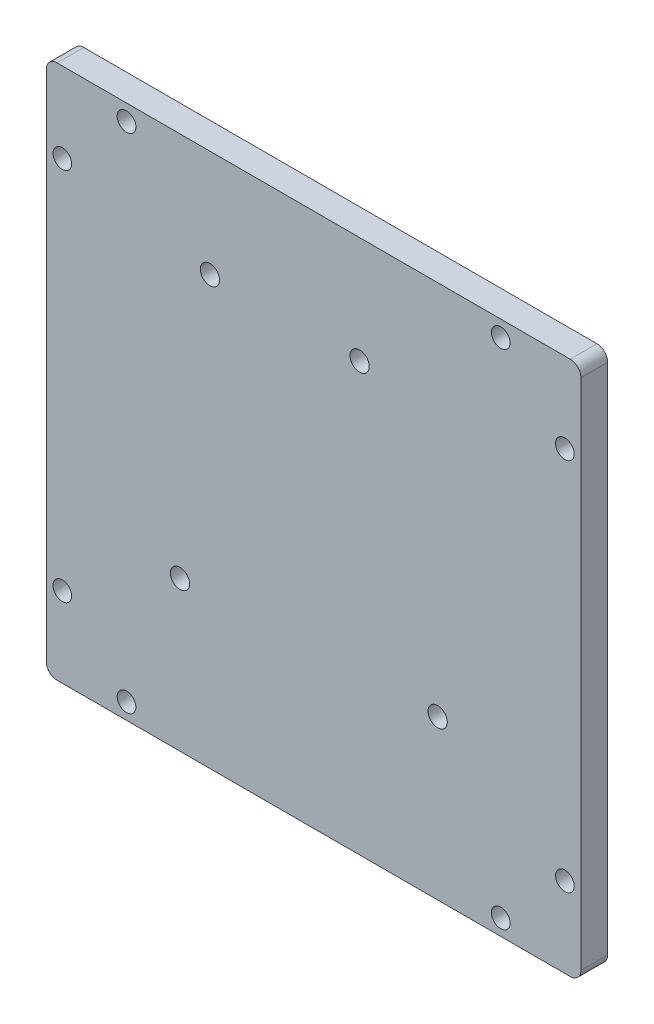
ISO-10303-21;
HEADER;
FILE_DESCRIPTION(('STEP AP214'),'2;1');
FILE_NAME('part.step','',(''),(''),'','','');
FILE_SCHEMA(('AUTOMOTIVE_DESIGN { 1 0 10303 214 1 1 1 1 }'));
ENDSEC;
DATA;
#1=APPLICATION_CONTEXT('core data for automotive mechanical design processes');
#2=APPLICATION_PROTOCOL_DEFINITION('international standard','automotive_design',2000,#1);
#3=PRODUCT_CONTEXT('',#1,'mechanical');
#4=PRODUCT('Part','Part','',(#3));
#5=PRODUCT_RELATED_PRODUCT_CATEGORY('part','',(#4));
#6=PRODUCT_DEFINITION_FORMATION('','',#4);
#7=PRODUCT_DEFINITION_CONTEXT('part definition',#1,'design');
#8=PRODUCT_DEFINITION('design','',#6,#7);
#9=PRODUCT_DEFINITION_SHAPE('','',#8);
#10=(LENGTH_UNIT() NAMED_UNIT(*) SI_UNIT(.MILLI.,.METRE.));
#11=(NAMED_UNIT(*) PLANE_ANGLE_UNIT() SI_UNIT($,.RADIAN.));
#12=(NAMED_UNIT(*) SI_UNIT($,.STERADIAN.) SOLID_ANGLE_UNIT());
#13=UNCERTAINTY_MEASURE_WITH_UNIT(LENGTH_MEASURE(1.E-05),#10,'distance_accuracy_value','');
#14=(GEOMETRIC_REPRESENTATION_CONTEXT(3) GLOBAL_UNCERTAINTY_ASSIGNED_CONTEXT((#13)) GLOBAL_UNIT_ASSIGNED_CONTEXT((#10,
#11,#12)) REPRESENTATION_CONTEXT('',''));
#15=CARTESIAN_POINT('',(0.,0.,0.));
#16=DIRECTION('',(0.,0.,1.));
#17=DIRECTION('',(1.,0.,0.));
#18=AXIS2_PLACEMENT_3D('',#15,#16,#17);
#19=CARTESIAN_POINT('',(-48.,-48.,5.));
#20=DIRECTION('',(0.,0.,1.));
#21=DIRECTION('',(1.,0.,0.));
#22=AXIS2_PLACEMENT_3D('',#19,#20,#21);
#23=PLANE('',#22);
#24=CARTESIAN_POINT('',(-25.,-22.,5.));
#25=DIRECTION('',(0.,0.,1.));
#26=DIRECTION('',(1.,0.,0.));
#27=AXIS2_PLACEMENT_3D('',#24,#25,#26);
#28=CIRCLE('',#27,1.8);
#29=CARTESIAN_POINT('',(-23.2,-22.,5.));
#30=VERTEX_POINT('',#29);
#31=EDGE_CURVE('E238',#30,#30,#28,.T.);
#32=ORIENTED_EDGE('',*,*,#31,.F.);
#33=EDGE_LOOP('',(#32));
#34=FACE_BOUND('',#33,.T.);
#35=CARTESIAN_POINT('',(-19.4,30.,5.));
#36=DIRECTION('',(0.,0.,1.));
#37=DIRECTION('',(1.,0.,0.));
#38=AXIS2_PLACEMENT_3D('',#35,#36,#37);
#39=CIRCLE('',#38,1.8);
#40=CARTESIAN_POINT('',(-17.6,30.,5.));
#41=VERTEX_POINT('',#40);
#42=EDGE_CURVE('E226',#41,#41,#39,.T.);
#43=ORIENTED_EDGE('',*,*,#42,.F.);
#44=EDGE_LOOP('',(#43));
#45=FACE_BOUND('',#44,.T.);
#46=CARTESIAN_POINT('',(-35.,-47.,5.));
#47=DIRECTION('',(0.,0.,1.));
#48=DIRECTION('',(-1.,0.,0.));
#49=AXIS2_PLACEMENT_3D('',#46,#47,#48);
#50=CIRCLE('',#49,1.75);
#51=CARTESIAN_POINT('',(-36.75,-47.,5.));
#52=VERTEX_POINT('',#51);
#53=EDGE_CURVE('E214',#52,#52,#50,.T.);
#54=ORIENTED_EDGE('',*,*,#53,.F.);
#55=EDGE_LOOP('',(#54));
#56=FACE_BOUND('',#55,.T.);
#57=CARTESIAN_POINT('',(-35.,47.,5.));
#58=DIRECTION('',(0.,0.,1.));
#59=DIRECTION('',(1.,0.,0.));
#60=AXIS2_PLACEMENT_3D('',#57,#58,#59);
#61=CIRCLE('',#60,1.75);
#62=CARTESIAN_POINT('',(-33.25,47.,5.));
#63=VERTEX_POINT('',#62);
#64=EDGE_CURVE('E202',#63,#63,#61,.T.);
#65=ORIENTED_EDGE('',*,*,#64,.F.);
#66=EDGE_LOOP('',(#65));
#67=FACE_BOUND('',#66,.T.);
#68=CARTESIAN_POINT('',(47.,-35.,5.));
#69=DIRECTION('',(0.,0.,1.));
#70=DIRECTION('',(1.,0.,0.));
#71=AXIS2_PLACEMENT_3D('',#68,#69,#70);
#72=CIRCLE('',#71,1.75);
#73=CARTESIAN_POINT('',(48.75,-35.,5.));
#74=VERTEX_POINT('',#73);
#75=EDGE_CURVE('E190',#74,#74,#72,.T.);
#76=ORIENTED_EDGE('',*,*,#75,.F.);
#77=EDGE_LOOP('',(#76));
#78=FACE_BOUND('',#77,.T.);
#79=CARTESIAN_POINT('',(-47.,35.,5.));
#80=DIRECTION('',(0.,0.,1.));
#81=DIRECTION('',(1.,0.,0.));
#82=AXIS2_PLACEMENT_3D('',#79,#80,#81);
#83=CIRCLE('',#82,1.75);
#84=CARTESIAN_POINT('',(-45.25,35.,5.));
#85=VERTEX_POINT('',#84);
#86=EDGE_CURVE('E136',#85,#85,#83,.T.);
#87=ORIENTED_EDGE('',*,*,#86,.F.);
#88=EDGE_LOOP('',(#87));
#89=FACE_BOUND('',#88,.T.);
#90=CARTESIAN_POINT('',(-48.,-48.,5.));
#91=DIRECTION('',(0.,0.,1.));
#92=DIRECTION('',(1.,0.,0.));
#93=AXIS2_PLACEMENT_3D('',#90,#91,#92);
#94=CIRCLE('',#93,2.);
#95=CARTESIAN_POINT('',(-50.,-48.,5.));
#96=VERTEX_POINT('',#95);
#97=CARTESIAN_POINT('',(-48.,-50.,5.));
#98=VERTEX_POINT('',#97);
#99=EDGE_CURVE('E147',#96,#98,#94,.T.);
#100=ORIENTED_EDGE('',*,*,#99,.T.);
#101=DIRECTION('',(1.,0.,0.));
#102=VECTOR('',#101,1.);
#103=CARTESIAN_POINT('',(-48.,-50.,5.));
#104=LINE('',#103,#102);
#105=CARTESIAN_POINT('',(48.,-50.,5.));
#106=VERTEX_POINT('',#105);
#107=EDGE_CURVE('E95',#98,#106,#104,.T.);
#108=ORIENTED_EDGE('',*,*,#107,.T.);
#109=CARTESIAN_POINT('',(48.,-48.,5.));
#110=DIRECTION('',(0.,0.,1.));
#111=DIRECTION('',(1.,0.,0.));
#112=AXIS2_PLACEMENT_3D('',#109,#110,#111);
#113=CIRCLE('',#112,2.);
#114=CARTESIAN_POINT('',(50.,-48.,5.));
#115=VERTEX_POINT('',#114);
#116=EDGE_CURVE('E162',#106,#115,#113,.T.);
#117=ORIENTED_EDGE('',*,*,#116,.T.);
#118=DIRECTION('',(0.,1.,0.));
#119=VECTOR('',#118,1.);
#120=CARTESIAN_POINT('',(50.,-48.,5.));
#121=LINE('',#120,#119);
#122=CARTESIAN_POINT('',(50.,48.,5.));
#123=VERTEX_POINT('',#122);
#124=EDGE_CURVE('E175',#115,#123,#121,.T.);
#125=ORIENTED_EDGE('',*,*,#124,.T.);
#126=CARTESIAN_POINT('',(48.,48.,5.));
#127=DIRECTION('',(0.,0.,1.));
#128=DIRECTION('',(1.,0.,0.));
#129=AXIS2_PLACEMENT_3D('',#126,#127,#128);
#130=CIRCLE('',#129,2.);
#131=CARTESIAN_POINT('',(48.,50.,5.));
#132=VERTEX_POINT('',#131);
#133=EDGE_CURVE('E114',#123,#132,#130,.T.);
#134=ORIENTED_EDGE('',*,*,#133,.T.);
#135=DIRECTION('',(-1.,0.,0.));
#136=VECTOR('',#135,1.);
#137=CARTESIAN_POINT('',(-48.,50.,5.));
#138=LINE('',#137,#136);
#139=CARTESIAN_POINT('',(-48.,50.,5.));
#140=VERTEX_POINT('',#139);
#141=EDGE_CURVE('E108',#132,#140,#138,.T.);
#142=ORIENTED_EDGE('',*,*,#141,.T.);
#143=CARTESIAN_POINT('',(-48.,48.,5.));
#144=DIRECTION('',(0.,0.,1.));
#145=DIRECTION('',(1.,0.,0.));
#146=AXIS2_PLACEMENT_3D('',#143,#144,#145);
#147=CIRCLE('',#146,2.);
#148=CARTESIAN_POINT('',(-50.,48.,5.));
#149=VERTEX_POINT('',#148);
#150=EDGE_CURVE('E112',#140,#149,#147,.T.);
#151=ORIENTED_EDGE('',*,*,#150,.T.);
#152=DIRECTION('',(0.,-1.,0.));
#153=VECTOR('',#152,1.);
#154=CARTESIAN_POINT('',(-50.,-48.,5.));
#155=LINE('',#154,#153);
#156=EDGE_CURVE('E52',#149,#96,#155,.T.);
#157=ORIENTED_EDGE('',*,*,#156,.T.);
#158=EDGE_LOOP('',(#100,#108,#117,#125,#134,#142,#151,#157));
#159=FACE_BOUND('',#158,.T.);
#160=CARTESIAN_POINT('',(47.,35.,5.));
#161=DIRECTION('',(0.,0.,1.));
#162=DIRECTION('',(-1.,0.,0.));
#163=AXIS2_PLACEMENT_3D('',#160,#161,#162);
#164=CIRCLE('',#163,1.75);
#165=CARTESIAN_POINT('',(45.25,35.,5.));
#166=VERTEX_POINT('',#165);
#167=EDGE_CURVE('E184',#166,#166,#164,.T.);
#168=ORIENTED_EDGE('',*,*,#167,.F.);
#169=EDGE_LOOP('',(#168));
#170=FACE_BOUND('',#169,.T.);
#171=CARTESIAN_POINT('',(-47.,-35.,5.));
#172=DIRECTION('',(0.,0.,1.));
#173=DIRECTION('',(-1.,0.,0.));
#174=AXIS2_PLACEMENT_3D('',#171,#172,#173);
#175=CIRCLE('',#174,1.75);
#176=CARTESIAN_POINT('',(-48.75,-35.,5.));
#177=VERTEX_POINT('',#176);
#178=EDGE_CURVE('E196',#177,#177,#175,.T.);
#179=ORIENTED_EDGE('',*,*,#178,.F.);
#180=EDGE_LOOP('',(#179));
#181=FACE_BOUND('',#180,.T.);
#182=CARTESIAN_POINT('',(35.,47.,5.));
#183=DIRECTION('',(0.,0.,1.));
#184=DIRECTION('',(-1.,0.,0.));
#185=AXIS2_PLACEMENT_3D('',#182,#183,#184);
#186=CIRCLE('',#185,1.75);
#187=CARTESIAN_POINT('',(33.25,47.,5.));
#188=VERTEX_POINT('',#187);
#189=EDGE_CURVE('E208',#188,#188,#186,.T.);
#190=ORIENTED_EDGE('',*,*,#189,.F.);
#191=EDGE_LOOP('',(#190));
#192=FACE_BOUND('',#191,.T.);
#193=CARTESIAN_POINT('',(35.,-47.,5.));
#194=DIRECTION('',(0.,0.,1.));
#195=DIRECTION('',(1.,0.,0.));
#196=AXIS2_PLACEMENT_3D('',#193,#194,#195);
#197=CIRCLE('',#196,1.75);
#198=CARTESIAN_POINT('',(36.75,-47.,5.));
#199=VERTEX_POINT('',#198);
#200=EDGE_CURVE('E220',#199,#199,#197,.T.);
#201=ORIENTED_EDGE('',*,*,#200,.F.);
#202=EDGE_LOOP('',(#201));
#203=FACE_BOUND('',#202,.T.);
#204=CARTESIAN_POINT('',(8.59999999999999,30.,5.));
#205=DIRECTION('',(0.,0.,1.));
#206=DIRECTION('',(1.,0.,0.));
#207=AXIS2_PLACEMENT_3D('',#204,#205,#206);
#208=CIRCLE('',#207,1.8);
#209=CARTESIAN_POINT('',(10.4,30.,5.));
#210=VERTEX_POINT('',#209);
#211=EDGE_CURVE('E232',#210,#210,#208,.T.);
#212=ORIENTED_EDGE('',*,*,#211,.F.);
#213=EDGE_LOOP('',(#212));
#214=FACE_BOUND('',#213,.T.);
#215=CARTESIAN_POINT('',(23.2,-20.3,5.));
#216=DIRECTION('',(0.,0.,1.));
#217=DIRECTION('',(1.,0.,0.));
#218=AXIS2_PLACEMENT_3D('',#215,#216,#217);
#219=CIRCLE('',#218,1.8);
#220=CARTESIAN_POINT('',(25.,-20.3,5.));
#221=VERTEX_POINT('',#220);
#222=EDGE_CURVE('E244',#221,#221,#219,.T.);
#223=ORIENTED_EDGE('',*,*,#222,.F.);
#224=EDGE_LOOP('',(#223));
#225=FACE_BOUND('',#224,.T.);
#226=ADVANCED_FACE('F35',(#34,#45,#56,#67,#78,#89,#159,#170,#181,#192,#203,#214,#225),#23,.T.);
#227=CARTESIAN_POINT('',(-48.,-48.,0.));
#228=DIRECTION('',(0.,0.,1.));
#229=DIRECTION('',(1.,0.,0.));
#230=AXIS2_PLACEMENT_3D('',#227,#228,#229);
#231=PLANE('',#230);
#232=CARTESIAN_POINT('',(-48.,-48.,0.));
#233=DIRECTION('',(0.,0.,1.));
#234=DIRECTION('',(1.,0.,0.));
#235=AXIS2_PLACEMENT_3D('',#232,#233,#234);
#236=CIRCLE('',#235,2.);
#237=CARTESIAN_POINT('',(-50.,-48.,0.));
#238=VERTEX_POINT('',#237);
#239=CARTESIAN_POINT('',(-48.,-50.,0.));
#240=VERTEX_POINT('',#239);
#241=EDGE_CURVE('E132',#238,#240,#236,.T.);
#242=ORIENTED_EDGE('',*,*,#241,.F.);
#243=DIRECTION('',(0.,-1.,0.));
#244=VECTOR('',#243,1.);
#245=CARTESIAN_POINT('',(-50.,-48.,0.));
#246=LINE('',#245,#244);
#247=CARTESIAN_POINT('',(-50.,48.,0.));
#248=VERTEX_POINT('',#247);
#249=EDGE_CURVE('E87',#248,#238,#246,.T.);
#250=ORIENTED_EDGE('',*,*,#249,.F.);
#251=CARTESIAN_POINT('',(-48.,48.,0.));
#252=DIRECTION('',(0.,0.,1.));
#253=DIRECTION('',(1.,0.,0.));
#254=AXIS2_PLACEMENT_3D('',#251,#252,#253);
#255=CIRCLE('',#254,2.);
#256=CARTESIAN_POINT('',(-48.,50.,0.));
#257=VERTEX_POINT('',#256);
#258=EDGE_CURVE('E81',#257,#248,#255,.T.);
#259=ORIENTED_EDGE('',*,*,#258,.F.);
#260=DIRECTION('',(-1.,0.,0.));
#261=VECTOR('',#260,1.);
#262=CARTESIAN_POINT('',(-48.,50.,0.));
#263=LINE('',#262,#261);
#264=CARTESIAN_POINT('',(48.,50.,0.));
#265=VERTEX_POINT('',#264);
#266=EDGE_CURVE('E122',#265,#257,#263,.T.);
#267=ORIENTED_EDGE('',*,*,#266,.F.);
#268=CARTESIAN_POINT('',(48.,48.,0.));
#269=DIRECTION('',(0.,0.,1.));
#270=DIRECTION('',(1.,0.,0.));
#271=AXIS2_PLACEMENT_3D('',#268,#269,#270);
#272=CIRCLE('',#271,2.);
#273=CARTESIAN_POINT('',(50.,48.,0.));
#274=VERTEX_POINT('',#273);
#275=EDGE_CURVE('E142',#274,#265,#272,.T.);
#276=ORIENTED_EDGE('',*,*,#275,.F.);
#277=DIRECTION('',(0.,1.,0.));
#278=VECTOR('',#277,1.);
#279=CARTESIAN_POINT('',(50.,-48.,0.));
#280=LINE('',#279,#278);
#281=CARTESIAN_POINT('',(50.,-48.,0.));
#282=VERTEX_POINT('',#281);
#283=EDGE_CURVE('E140',#282,#274,#280,.T.);
#284=ORIENTED_EDGE('',*,*,#283,.F.);
#285=CARTESIAN_POINT('',(48.,-48.,0.));
#286=DIRECTION('',(0.,0.,1.));
#287=DIRECTION('',(1.,0.,0.));
#288=AXIS2_PLACEMENT_3D('',#285,#286,#287);
#289=CIRCLE('',#288,2.);
#290=CARTESIAN_POINT('',(48.,-50.,0.));
#291=VERTEX_POINT('',#290);
#292=EDGE_CURVE('E138',#291,#282,#289,.T.);
#293=ORIENTED_EDGE('',*,*,#292,.F.);
#294=DIRECTION('',(1.,0.,0.));
#295=VECTOR('',#294,1.);
#296=CARTESIAN_POINT('',(-48.,-50.,0.));
#297=LINE('',#296,#295);
#298=EDGE_CURVE('E135',#240,#291,#297,.T.);
#299=ORIENTED_EDGE('',*,*,#298,.F.);
#300=EDGE_LOOP('',(#242,#250,#259,#267,#276,#284,#293,#299));
#301=FACE_BOUND('',#300,.T.);
#302=CARTESIAN_POINT('',(-47.,35.,0.));
#303=DIRECTION('',(0.,0.,1.));
#304=DIRECTION('',(1.,0.,0.));
#305=AXIS2_PLACEMENT_3D('',#302,#303,#304);
#306=CIRCLE('',#305,1.75);
#307=CARTESIAN_POINT('',(-45.25,35.,0.));
#308=VERTEX_POINT('',#307);
#309=EDGE_CURVE('E181',#308,#308,#306,.T.);
#310=ORIENTED_EDGE('',*,*,#309,.T.);
#311=EDGE_LOOP('',(#310));
#312=FACE_BOUND('',#311,.T.);
#313=CARTESIAN_POINT('',(47.,35.,0.));
#314=DIRECTION('',(0.,0.,1.));
#315=DIRECTION('',(-1.,0.,0.));
#316=AXIS2_PLACEMENT_3D('',#313,#314,#315);
#317=CIRCLE('',#316,1.75);
#318=CARTESIAN_POINT('',(45.25,35.,0.));
#319=VERTEX_POINT('',#318);
#320=EDGE_CURVE('E187',#319,#319,#317,.T.);
#321=ORIENTED_EDGE('',*,*,#320,.T.);
#322=EDGE_LOOP('',(#321));
#323=FACE_BOUND('',#322,.T.);
#324=CARTESIAN_POINT('',(47.,-35.,0.));
#325=DIRECTION('',(0.,0.,1.));
#326=DIRECTION('',(1.,0.,0.));
#327=AXIS2_PLACEMENT_3D('',#324,#325,#326);
#328=CIRCLE('',#327,1.75);
#329=CARTESIAN_POINT('',(48.75,-35.,0.));
#330=VERTEX_POINT('',#329);
#331=EDGE_CURVE('E193',#330,#330,#328,.T.);
#332=ORIENTED_EDGE('',*,*,#331,.T.);
#333=EDGE_LOOP('',(#332));
#334=FACE_BOUND('',#333,.T.);
#335=CARTESIAN_POINT('',(-47.,-35.,0.));
#336=DIRECTION('',(0.,0.,1.));
#337=DIRECTION('',(-1.,0.,0.));
#338=AXIS2_PLACEMENT_3D('',#335,#336,#337);
#339=CIRCLE('',#338,1.75);
#340=CARTESIAN_POINT('',(-48.75,-35.,0.));
#341=VERTEX_POINT('',#340);
#342=EDGE_CURVE('E199',#341,#341,#339,.T.);
#343=ORIENTED_EDGE('',*,*,#342,.T.);
#344=EDGE_LOOP('',(#343));
#345=FACE_BOUND('',#344,.T.);
#346=CARTESIAN_POINT('',(-35.,47.,0.));
#347=DIRECTION('',(0.,0.,1.));
#348=DIRECTION('',(1.,0.,0.));
#349=AXIS2_PLACEMENT_3D('',#346,#347,#348);
#350=CIRCLE('',#349,1.75);
#351=CARTESIAN_POINT('',(-33.25,47.,0.));
#352=VERTEX_POINT('',#351);
#353=EDGE_CURVE('E205',#352,#352,#350,.T.);
#354=ORIENTED_EDGE('',*,*,#353,.T.);
#355=EDGE_LOOP('',(#354));
#356=FACE_BOUND('',#355,.T.);
#357=CARTESIAN_POINT('',(35.,47.,0.));
#358=DIRECTION('',(0.,0.,1.));
#359=DIRECTION('',(-1.,0.,0.));
#360=AXIS2_PLACEMENT_3D('',#357,#358,#359);
#361=CIRCLE('',#360,1.75);
#362=CARTESIAN_POINT('',(33.25,47.,0.));
#363=VERTEX_POINT('',#362);
#364=EDGE_CURVE('E211',#363,#363,#361,.T.);
#365=ORIENTED_EDGE('',*,*,#364,.T.);
#366=EDGE_LOOP('',(#365));
#367=FACE_BOUND('',#366,.T.);
#368=CARTESIAN_POINT('',(-35.,-47.,0.));
#369=DIRECTION('',(0.,0.,1.));
#370=DIRECTION('',(-1.,0.,0.));
#371=AXIS2_PLACEMENT_3D('',#368,#369,#370);
#372=CIRCLE('',#371,1.75);
#373=CARTESIAN_POINT('',(-36.75,-47.,0.));
#374=VERTEX_POINT('',#373);
#375=EDGE_CURVE('E217',#374,#374,#372,.T.);
#376=ORIENTED_EDGE('',*,*,#375,.T.);
#377=EDGE_LOOP('',(#376));
#378=FACE_BOUND('',#377,.T.);
#379=CARTESIAN_POINT('',(35.,-47.,0.));
#380=DIRECTION('',(0.,0.,1.));
#381=DIRECTION('',(1.,0.,0.));
#382=AXIS2_PLACEMENT_3D('',#379,#380,#381);
#383=CIRCLE('',#382,1.75);
#384=CARTESIAN_POINT('',(36.75,-47.,0.));
#385=VERTEX_POINT('',#384);
#386=EDGE_CURVE('E223',#385,#385,#383,.T.);
#387=ORIENTED_EDGE('',*,*,#386,.T.);
#388=EDGE_LOOP('',(#387));
#389=FACE_BOUND('',#388,.T.);
#390=CARTESIAN_POINT('',(-19.4,30.,0.));
#391=DIRECTION('',(0.,0.,1.));
#392=DIRECTION('',(1.,0.,0.));
#393=AXIS2_PLACEMENT_3D('',#390,#391,#392);
#394=CIRCLE('',#393,1.8);
#395=CARTESIAN_POINT('',(-17.6,30.,0.));
#396=VERTEX_POINT('',#395);
#397=EDGE_CURVE('E229',#396,#396,#394,.T.);
#398=ORIENTED_EDGE('',*,*,#397,.T.);
#399=EDGE_LOOP('',(#398));
#400=FACE_BOUND('',#399,.T.);
#401=CARTESIAN_POINT('',(8.59999999999999,30.,0.));
#402=DIRECTION('',(0.,0.,1.));
#403=DIRECTION('',(1.,0.,0.));
#404=AXIS2_PLACEMENT_3D('',#401,#402,#403);
#405=CIRCLE('',#404,1.8);
#406=CARTESIAN_POINT('',(10.4,30.,0.));
#407=VERTEX_POINT('',#406);
#408=EDGE_CURVE('E235',#407,#407,#405,.T.);
#409=ORIENTED_EDGE('',*,*,#408,.T.);
#410=EDGE_LOOP('',(#409));
#411=FACE_BOUND('',#410,.T.);
#412=CARTESIAN_POINT('',(-25.,-22.,0.));
#413=DIRECTION('',(0.,0.,1.));
#414=DIRECTION('',(1.,0.,0.));
#415=AXIS2_PLACEMENT_3D('',#412,#413,#414);
#416=CIRCLE('',#415,1.8);
#417=CARTESIAN_POINT('',(-23.2,-22.,0.));
#418=VERTEX_POINT('',#417);
#419=EDGE_CURVE('E241',#418,#418,#416,.T.);
#420=ORIENTED_EDGE('',*,*,#419,.T.);
#421=EDGE_LOOP('',(#420));
#422=FACE_BOUND('',#421,.T.);
#423=CARTESIAN_POINT('',(23.2,-20.3,0.));
#424=DIRECTION('',(0.,0.,1.));
#425=DIRECTION('',(1.,0.,0.));
#426=AXIS2_PLACEMENT_3D('',#423,#424,#425);
#427=CIRCLE('',#426,1.8);
#428=CARTESIAN_POINT('',(25.,-20.3,0.));
#429=VERTEX_POINT('',#428);
#430=EDGE_CURVE('E247',#429,#429,#427,.T.);
#431=ORIENTED_EDGE('',*,*,#430,.T.);
#432=EDGE_LOOP('',(#431));
#433=FACE_BOUND('',#432,.T.);
#434=ADVANCED_FACE('F166',(#301,#312,#323,#334,#345,#356,#367,#378,#389,#400,#411,#422,#433),
#231,.F.);
#435=CARTESIAN_POINT('',(-48.,-48.,5.));
#436=DIRECTION('',(0.,0.,-1.));
#437=DIRECTION('',(-1.,0.,0.));
#438=AXIS2_PLACEMENT_3D('',#435,#436,#437);
#439=CYLINDRICAL_SURFACE('',#438,2.);
#440=ORIENTED_EDGE('',*,*,#241,.T.);
#441=DIRECTION('',(0.,0.,-1.));
#442=VECTOR('',#441,1.);
#443=CARTESIAN_POINT('',(-48.,-50.,5.));
#444=LINE('',#443,#442);
#445=EDGE_CURVE('E11',#98,#240,#444,.T.);
#446=ORIENTED_EDGE('',*,*,#445,.F.);
#447=ORIENTED_EDGE('',*,*,#99,.F.);
#448=DIRECTION('',(0.,0.,-1.));
#449=VECTOR('',#448,1.);
#450=CARTESIAN_POINT('',(-50.,-48.,5.));
#451=LINE('',#450,#449);
#452=EDGE_CURVE('E128',#96,#238,#451,.T.);
#453=ORIENTED_EDGE('',*,*,#452,.T.);
#454=EDGE_LOOP('',(#440,#446,#447,#453));
#455=FACE_BOUND('',#454,.T.);
#456=ADVANCED_FACE('F37',(#455),#439,.T.);
#457=CARTESIAN_POINT('',(-48.,-50.,5.));
#458=DIRECTION('',(0.,1.,0.));
#459=DIRECTION('',(0.,0.,1.));
#460=AXIS2_PLACEMENT_3D('',#457,#458,#459);
#461=PLANE('',#460);
#462=ORIENTED_EDGE('',*,*,#298,.T.);
#463=DIRECTION('',(0.,0.,-1.));
#464=VECTOR('',#463,1.);
#465=CARTESIAN_POINT('',(48.,-50.,5.));
#466=LINE('',#465,#464);
#467=EDGE_CURVE('E44',#106,#291,#466,.T.);
#468=ORIENTED_EDGE('',*,*,#467,.F.);
#469=ORIENTED_EDGE('',*,*,#107,.F.);
#470=ORIENTED_EDGE('',*,*,#445,.T.);
#471=EDGE_LOOP('',(#462,#468,#469,#470));
#472=FACE_BOUND('',#471,.T.);
#473=ADVANCED_FACE('F281',(#472),#461,.F.);
#474=CARTESIAN_POINT('',(48.,-48.,5.));
#475=DIRECTION('',(0.,0.,-1.));
#476=DIRECTION('',(-1.,0.,0.));
#477=AXIS2_PLACEMENT_3D('',#474,#475,#476);
#478=CYLINDRICAL_SURFACE('',#477,2.);
#479=ORIENTED_EDGE('',*,*,#292,.T.);
#480=DIRECTION('',(0.,0.,-1.));
#481=VECTOR('',#480,1.);
#482=CARTESIAN_POINT('',(50.,-48.,5.));
#483=LINE('',#482,#481);
#484=EDGE_CURVE('E154',#115,#282,#483,.T.);
#485=ORIENTED_EDGE('',*,*,#484,.F.);
#486=ORIENTED_EDGE('',*,*,#116,.F.);
#487=ORIENTED_EDGE('',*,*,#467,.T.);
#488=EDGE_LOOP('',(#479,#485,#486,#487));
#489=FACE_BOUND('',#488,.T.);
#490=ADVANCED_FACE('F160',(#489),#478,.T.);
#491=CARTESIAN_POINT('',(50.,-48.,5.));
#492=DIRECTION('',(-1.,0.,0.));
#493=DIRECTION('',(0.,0.,1.));
#494=AXIS2_PLACEMENT_3D('',#491,#492,#493);
#495=PLANE('',#494);
#496=ORIENTED_EDGE('',*,*,#283,.T.);
#497=DIRECTION('',(0.,0.,-1.));
#498=VECTOR('',#497,1.);
#499=CARTESIAN_POINT('',(50.,48.,5.));
#500=LINE('',#499,#498);
#501=EDGE_CURVE('E151',#123,#274,#500,.T.);
#502=ORIENTED_EDGE('',*,*,#501,.F.);
#503=ORIENTED_EDGE('',*,*,#124,.F.);
#504=ORIENTED_EDGE('',*,*,#484,.T.);
#505=EDGE_LOOP('',(#496,#502,#503,#504));
#506=FACE_BOUND('',#505,.T.);
#507=ADVANCED_FACE('F171',(#506),#495,.F.);
#508=CARTESIAN_POINT('',(48.,48.,5.));
#509=DIRECTION('',(0.,0.,-1.));
#510=DIRECTION('',(-1.,0.,0.));
#511=AXIS2_PLACEMENT_3D('',#508,#509,#510);
#512=CYLINDRICAL_SURFACE('',#511,2.);
#513=ORIENTED_EDGE('',*,*,#275,.T.);
#514=DIRECTION('',(0.,0.,-1.));
#515=VECTOR('',#514,1.);
#516=CARTESIAN_POINT('',(48.,50.,5.));
#517=LINE('',#516,#515);
#518=EDGE_CURVE('E123',#132,#265,#517,.T.);
#519=ORIENTED_EDGE('',*,*,#518,.F.);
#520=ORIENTED_EDGE('',*,*,#133,.F.);
#521=ORIENTED_EDGE('',*,*,#501,.T.);
#522=EDGE_LOOP('',(#513,#519,#520,#521));
#523=FACE_BOUND('',#522,.T.);
#524=ADVANCED_FACE('F174',(#523),#512,.T.);
#525=CARTESIAN_POINT('',(-48.,50.,5.));
#526=DIRECTION('',(0.,-1.,0.));
#527=DIRECTION('',(0.,0.,-1.));
#528=AXIS2_PLACEMENT_3D('',#525,#526,#527);
#529=PLANE('',#528);
#530=ORIENTED_EDGE('',*,*,#266,.T.);
#531=DIRECTION('',(0.,0.,-1.));
#532=VECTOR('',#531,1.);
#533=CARTESIAN_POINT('',(-48.,50.,5.));
#534=LINE('',#533,#532);
#535=EDGE_CURVE('E119',#140,#257,#534,.T.);
#536=ORIENTED_EDGE('',*,*,#535,.F.);
#537=ORIENTED_EDGE('',*,*,#141,.F.);
#538=ORIENTED_EDGE('',*,*,#518,.T.);
#539=EDGE_LOOP('',(#530,#536,#537,#538));
#540=FACE_BOUND('',#539,.T.);
#541=ADVANCED_FACE('F120',(#540),#529,.F.);
#542=CARTESIAN_POINT('',(-48.,48.,5.));
#543=DIRECTION('',(0.,0.,-1.));
#544=DIRECTION('',(-1.,0.,0.));
#545=AXIS2_PLACEMENT_3D('',#542,#543,#544);
#546=CYLINDRICAL_SURFACE('',#545,2.);
#547=ORIENTED_EDGE('',*,*,#258,.T.);
#548=DIRECTION('',(0.,0.,-1.));
#549=VECTOR('',#548,1.);
#550=CARTESIAN_POINT('',(-50.,48.,5.));
#551=LINE('',#550,#549);
#552=EDGE_CURVE('E124',#149,#248,#551,.T.);
#553=ORIENTED_EDGE('',*,*,#552,.F.);
#554=ORIENTED_EDGE('',*,*,#150,.F.);
#555=ORIENTED_EDGE('',*,*,#535,.T.);
#556=EDGE_LOOP('',(#547,#553,#554,#555));
#557=FACE_BOUND('',#556,.T.);
#558=ADVANCED_FACE('F126',(#557),#546,.T.);
#559=CARTESIAN_POINT('',(-50.,-48.,5.));
#560=DIRECTION('',(1.,0.,0.));
#561=DIRECTION('',(0.,0.,-1.));
#562=AXIS2_PLACEMENT_3D('',#559,#560,#561);
#563=PLANE('',#562);
#564=ORIENTED_EDGE('',*,*,#249,.T.);
#565=ORIENTED_EDGE('',*,*,#452,.F.);
#566=ORIENTED_EDGE('',*,*,#156,.F.);
#567=ORIENTED_EDGE('',*,*,#552,.T.);
#568=EDGE_LOOP('',(#564,#565,#566,#567));
#569=FACE_BOUND('',#568,.T.);
#570=ADVANCED_FACE('F269',(#569),#563,.F.);
#571=CARTESIAN_POINT('',(-47.,35.,5.));
#572=DIRECTION('',(0.,0.,-1.));
#573=DIRECTION('',(-1.,0.,0.));
#574=AXIS2_PLACEMENT_3D('',#571,#572,#573);
#575=CYLINDRICAL_SURFACE('',#574,1.75);
#576=ORIENTED_EDGE('',*,*,#86,.T.);
#577=EDGE_LOOP('',(#576));
#578=FACE_BOUND('',#577,.T.);
#579=ORIENTED_EDGE('',*,*,#309,.F.);
#580=EDGE_LOOP('',(#579));
#581=FACE_BOUND('',#580,.T.);
#582=ADVANCED_FACE('F266',(#578,#581),#575,.F.);
#583=CARTESIAN_POINT('',(47.,35.,5.));
#584=DIRECTION('',(0.,0.,-1.));
#585=DIRECTION('',(-1.,0.,0.));
#586=AXIS2_PLACEMENT_3D('',#583,#584,#585);
#587=CYLINDRICAL_SURFACE('',#586,1.75);
#588=ORIENTED_EDGE('',*,*,#167,.T.);
#589=EDGE_LOOP('',(#588));
#590=FACE_BOUND('',#589,.T.);
#591=ORIENTED_EDGE('',*,*,#320,.F.);
#592=EDGE_LOOP('',(#591));
#593=FACE_BOUND('',#592,.T.);
#594=ADVANCED_FACE('F345',(#590,#593),#587,.F.);
#595=CARTESIAN_POINT('',(47.,-35.,5.));
#596=DIRECTION('',(0.,0.,-1.));
#597=DIRECTION('',(-1.,0.,0.));
#598=AXIS2_PLACEMENT_3D('',#595,#596,#597);
#599=CYLINDRICAL_SURFACE('',#598,1.75);
#600=ORIENTED_EDGE('',*,*,#75,.T.);
#601=EDGE_LOOP('',(#600));
#602=FACE_BOUND('',#601,.T.);
#603=ORIENTED_EDGE('',*,*,#331,.F.);
#604=EDGE_LOOP('',(#603));
#605=FACE_BOUND('',#604,.T.);
#606=ADVANCED_FACE('F353',(#602,#605),#599,.F.);
#607=CARTESIAN_POINT('',(-47.,-35.,5.));
#608=DIRECTION('',(0.,0.,-1.));
#609=DIRECTION('',(-1.,0.,0.));
#610=AXIS2_PLACEMENT_3D('',#607,#608,#609);
#611=CYLINDRICAL_SURFACE('',#610,1.75);
#612=ORIENTED_EDGE('',*,*,#178,.T.);
#613=EDGE_LOOP('',(#612));
#614=FACE_BOUND('',#613,.T.);
#615=ORIENTED_EDGE('',*,*,#342,.F.);
#616=EDGE_LOOP('',(#615));
#617=FACE_BOUND('',#616,.T.);
#618=ADVANCED_FACE('F361',(#614,#617),#611,.F.);
#619=CARTESIAN_POINT('',(-35.,47.,5.));
#620=DIRECTION('',(0.,0.,-1.));
#621=DIRECTION('',(-1.,0.,0.));
#622=AXIS2_PLACEMENT_3D('',#619,#620,#621);
#623=CYLINDRICAL_SURFACE('',#622,1.75);
#624=ORIENTED_EDGE('',*,*,#64,.T.);
#625=EDGE_LOOP('',(#624));
#626=FACE_BOUND('',#625,.T.);
#627=ORIENTED_EDGE('',*,*,#353,.F.);
#628=EDGE_LOOP('',(#627));
#629=FACE_BOUND('',#628,.T.);
#630=ADVANCED_FACE('F370',(#626,#629),#623,.F.);
#631=CARTESIAN_POINT('',(35.,47.,5.));
#632=DIRECTION('',(0.,0.,-1.));
#633=DIRECTION('',(-1.,0.,0.));
#634=AXIS2_PLACEMENT_3D('',#631,#632,#633);
#635=CYLINDRICAL_SURFACE('',#634,1.75);
#636=ORIENTED_EDGE('',*,*,#189,.T.);
#637=EDGE_LOOP('',(#636));
#638=FACE_BOUND('',#637,.T.);
#639=ORIENTED_EDGE('',*,*,#364,.F.);
#640=EDGE_LOOP('',(#639));
#641=FACE_BOUND('',#640,.T.);
#642=ADVANCED_FACE('F379',(#638,#641),#635,.F.);
#643=CARTESIAN_POINT('',(-35.,-47.,5.));
#644=DIRECTION('',(0.,0.,-1.));
#645=DIRECTION('',(-1.,0.,0.));
#646=AXIS2_PLACEMENT_3D('',#643,#644,#645);
#647=CYLINDRICAL_SURFACE('',#646,1.75);
#648=ORIENTED_EDGE('',*,*,#53,.T.);
#649=EDGE_LOOP('',(#648));
#650=FACE_BOUND('',#649,.T.);
#651=ORIENTED_EDGE('',*,*,#375,.F.);
#652=EDGE_LOOP('',(#651));
#653=FACE_BOUND('',#652,.T.);
#654=ADVANCED_FACE('F388',(#650,#653),#647,.F.);
#655=CARTESIAN_POINT('',(35.,-47.,5.));
#656=DIRECTION('',(0.,0.,-1.));
#657=DIRECTION('',(-1.,0.,0.));
#658=AXIS2_PLACEMENT_3D('',#655,#656,#657);
#659=CYLINDRICAL_SURFACE('',#658,1.75);
#660=ORIENTED_EDGE('',*,*,#200,.T.);
#661=EDGE_LOOP('',(#660));
#662=FACE_BOUND('',#661,.T.);
#663=ORIENTED_EDGE('',*,*,#386,.F.);
#664=EDGE_LOOP('',(#663));
#665=FACE_BOUND('',#664,.T.);
#666=ADVANCED_FACE('F397',(#662,#665),#659,.F.);
#667=CARTESIAN_POINT('',(-19.4,30.,5.));
#668=DIRECTION('',(0.,0.,-1.));
#669=DIRECTION('',(-1.,0.,0.));
#670=AXIS2_PLACEMENT_3D('',#667,#668,#669);
#671=CYLINDRICAL_SURFACE('',#670,1.8);
#672=ORIENTED_EDGE('',*,*,#42,.T.);
#673=EDGE_LOOP('',(#672));
#674=FACE_BOUND('',#673,.T.);
#675=ORIENTED_EDGE('',*,*,#397,.F.);
#676=EDGE_LOOP('',(#675));
#677=FACE_BOUND('',#676,.T.);
#678=ADVANCED_FACE('F406',(#674,#677),#671,.F.);
#679=CARTESIAN_POINT('',(8.59999999999999,30.,5.));
#680=DIRECTION('',(0.,0.,-1.));
#681=DIRECTION('',(-1.,0.,0.));
#682=AXIS2_PLACEMENT_3D('',#679,#680,#681);
#683=CYLINDRICAL_SURFACE('',#682,1.8);
#684=ORIENTED_EDGE('',*,*,#211,.T.);
#685=EDGE_LOOP('',(#684));
#686=FACE_BOUND('',#685,.T.);
#687=ORIENTED_EDGE('',*,*,#408,.F.);
#688=EDGE_LOOP('',(#687));
#689=FACE_BOUND('',#688,.T.);
#690=ADVANCED_FACE('F415',(#686,#689),#683,.F.);
#691=CARTESIAN_POINT('',(-25.,-22.,5.));
#692=DIRECTION('',(0.,0.,-1.));
#693=DIRECTION('',(-1.,0.,0.));
#694=AXIS2_PLACEMENT_3D('',#691,#692,#693);
#695=CYLINDRICAL_SURFACE('',#694,1.8);
#696=ORIENTED_EDGE('',*,*,#31,.T.);
#697=EDGE_LOOP('',(#696));
#698=FACE_BOUND('',#697,.T.);
#699=ORIENTED_EDGE('',*,*,#419,.F.);
#700=EDGE_LOOP('',(#699));
#701=FACE_BOUND('',#700,.T.);
#702=ADVANCED_FACE('F424',(#698,#701),#695,.F.);
#703=CARTESIAN_POINT('',(23.2,-20.3,5.));
#704=DIRECTION('',(0.,0.,-1.));
#705=DIRECTION('',(-1.,0.,0.));
#706=AXIS2_PLACEMENT_3D('',#703,#704,#705);
#707=CYLINDRICAL_SURFACE('',#706,1.8);
#708=ORIENTED_EDGE('',*,*,#222,.T.);
#709=EDGE_LOOP('',(#708));
#710=FACE_BOUND('',#709,.T.);
#711=ORIENTED_EDGE('',*,*,#430,.F.);
#712=EDGE_LOOP('',(#711));
#713=FACE_BOUND('',#712,.T.);
#714=ADVANCED_FACE('F253',(#710,#713),#707,.F.);
#715=CLOSED_SHELL('',(#226,#434,#456,#473,#490,#507,#524,#541,#558,#570,#582,#594,#606,#618,
#630,#642,#654,#666,#678,#690,#702,#714));
#716=MANIFOLD_SOLID_BREP('B2',#715);
#717=ADVANCED_BREP_SHAPE_REPRESENTATION('',(#18,#716),#14);
#718=SHAPE_DEFINITION_REPRESENTATION(#9,#717);
ENDSEC;
END-ISO-10303-21;
